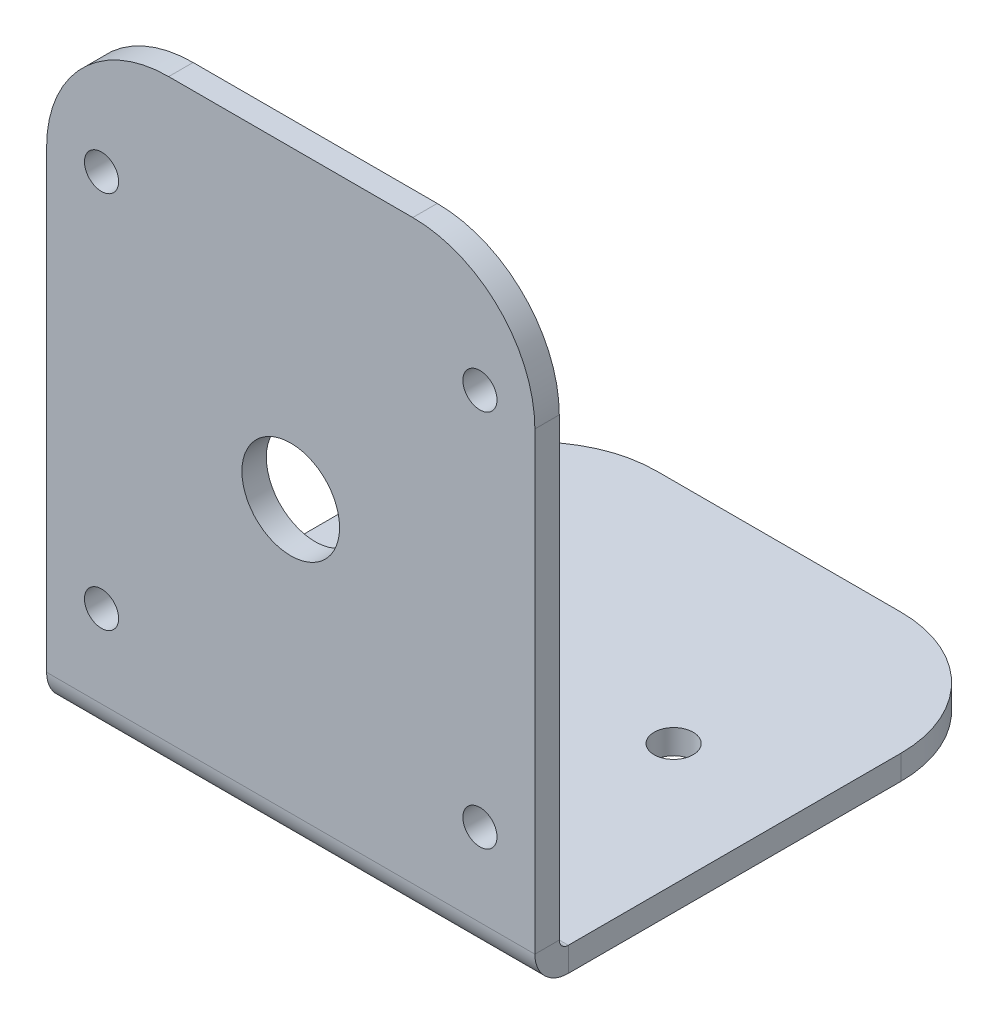
ISO-10303-21;
HEADER;
FILE_DESCRIPTION(('STEP AP214'),'2;1');
FILE_NAME('part.step','',(''),(''),'','','');
FILE_SCHEMA(('AUTOMOTIVE_DESIGN { 1 0 10303 214 1 1 1 1 }'));
ENDSEC;
DATA;
#1=APPLICATION_CONTEXT('core data for automotive mechanical design processes');
#2=APPLICATION_PROTOCOL_DEFINITION('international standard','automotive_design',2000,#1);
#3=PRODUCT_CONTEXT('',#1,'mechanical');
#4=PRODUCT('Part','Part','',(#3));
#5=PRODUCT_RELATED_PRODUCT_CATEGORY('part','',(#4));
#6=PRODUCT_DEFINITION_FORMATION('','',#4);
#7=PRODUCT_DEFINITION_CONTEXT('part definition',#1,'design');
#8=PRODUCT_DEFINITION('design','',#6,#7);
#9=PRODUCT_DEFINITION_SHAPE('','',#8);
#10=(LENGTH_UNIT() NAMED_UNIT(*) SI_UNIT(.MILLI.,.METRE.));
#11=(NAMED_UNIT(*) PLANE_ANGLE_UNIT() SI_UNIT($,.RADIAN.));
#12=(NAMED_UNIT(*) SI_UNIT($,.STERADIAN.) SOLID_ANGLE_UNIT());
#13=UNCERTAINTY_MEASURE_WITH_UNIT(LENGTH_MEASURE(1.E-05),#10,'distance_accuracy_value','');
#14=(GEOMETRIC_REPRESENTATION_CONTEXT(3) GLOBAL_UNCERTAINTY_ASSIGNED_CONTEXT((#13)) GLOBAL_UNIT_ASSIGNED_CONTEXT((#10,
#11,#12)) REPRESENTATION_CONTEXT('',''));
#15=CARTESIAN_POINT('',(0.,0.,0.));
#16=DIRECTION('',(0.,0.,1.));
#17=DIRECTION('',(1.,0.,0.));
#18=AXIS2_PLACEMENT_3D('',#15,#16,#17);
#19=CARTESIAN_POINT('',(-20.,25.,-2.));
#20=DIRECTION('',(-1.,0.,0.));
#21=DIRECTION('',(0.,-1.,0.));
#22=AXIS2_PLACEMENT_3D('',#19,#20,#21);
#23=PLANE('',#22);
#24=DIRECTION('',(0.,-1.,0.));
#25=VECTOR('',#24,1.);
#26=CARTESIAN_POINT('',(-20.,25.,0.));
#27=LINE('',#26,#25);
#28=CARTESIAN_POINT('',(-20.,15.,0.));
#29=VERTEX_POINT('',#28);
#30=CARTESIAN_POINT('',(-20.,-22.2634,0.));
#31=VERTEX_POINT('',#30);
#32=EDGE_CURVE('E219',#29,#31,#27,.T.);
#33=ORIENTED_EDGE('',*,*,#32,.F.);
#34=DIRECTION('',(0.,0.,1.));
#35=VECTOR('',#34,1.);
#36=CARTESIAN_POINT('',(-20.,15.,-2.));
#37=LINE('',#36,#35);
#38=CARTESIAN_POINT('',(-20.,15.,-2.));
#39=VERTEX_POINT('',#38);
#40=EDGE_CURVE('E78',#29,#39,#37,.F.);
#41=ORIENTED_EDGE('',*,*,#40,.T.);
#42=DIRECTION('',(0.,-1.,0.));
#43=VECTOR('',#42,1.);
#44=CARTESIAN_POINT('',(-20.,25.,-2.));
#45=LINE('',#44,#43);
#46=CARTESIAN_POINT('',(-20.,-22.2634,-2.));
#47=VERTEX_POINT('',#46);
#48=EDGE_CURVE('E222',#39,#47,#45,.T.);
#49=ORIENTED_EDGE('',*,*,#48,.T.);
#50=DIRECTION('',(0.,0.,1.));
#51=VECTOR('',#50,1.);
#52=CARTESIAN_POINT('',(-20.,-22.2634,-2.));
#53=LINE('',#52,#51);
#54=EDGE_CURVE('E204',#47,#31,#53,.T.);
#55=ORIENTED_EDGE('',*,*,#54,.T.);
#56=EDGE_LOOP('',(#33,#41,#49,#55));
#57=FACE_BOUND('',#56,.T.);
#58=ADVANCED_FACE('F55',(#57),#23,.T.);
#59=CARTESIAN_POINT('',(0.,0.,-2.));
#60=DIRECTION('',(0.,0.,1.));
#61=DIRECTION('',(1.,0.,0.));
#62=AXIS2_PLACEMENT_3D('',#59,#60,#61);
#63=PLANE('',#62);
#64=CARTESIAN_POINT('',(0.,0.,-2.));
#65=DIRECTION('',(0.,0.,-1.));
#66=DIRECTION('',(-1.,0.,0.));
#67=AXIS2_PLACEMENT_3D('',#64,#65,#66);
#68=CIRCLE('',#67,4.);
#69=CARTESIAN_POINT('',(-4.00000000000001,0.,-2.));
#70=VERTEX_POINT('',#69);
#71=EDGE_CURVE('E325',#70,#70,#68,.T.);
#72=ORIENTED_EDGE('',*,*,#71,.F.);
#73=EDGE_LOOP('',(#72));
#74=FACE_BOUND('',#73,.T.);
#75=CARTESIAN_POINT('',(15.5,-15.5,-2.));
#76=DIRECTION('',(0.,0.,-1.));
#77=DIRECTION('',(-1.,0.,0.));
#78=AXIS2_PLACEMENT_3D('',#75,#76,#77);
#79=CIRCLE('',#78,1.4);
#80=CARTESIAN_POINT('',(14.1,-15.5,-2.));
#81=VERTEX_POINT('',#80);
#82=EDGE_CURVE('E332',#81,#81,#79,.T.);
#83=ORIENTED_EDGE('',*,*,#82,.F.);
#84=EDGE_LOOP('',(#83));
#85=FACE_BOUND('',#84,.T.);
#86=CARTESIAN_POINT('',(-15.5,-15.5,-2.));
#87=DIRECTION('',(0.,0.,-1.));
#88=DIRECTION('',(-1.,0.,0.));
#89=AXIS2_PLACEMENT_3D('',#86,#87,#88);
#90=CIRCLE('',#89,1.4);
#91=CARTESIAN_POINT('',(-16.9,-15.5,-2.));
#92=VERTEX_POINT('',#91);
#93=EDGE_CURVE('E338',#92,#92,#90,.T.);
#94=ORIENTED_EDGE('',*,*,#93,.F.);
#95=EDGE_LOOP('',(#94));
#96=FACE_BOUND('',#95,.T.);
#97=CARTESIAN_POINT('',(-15.5,15.5,-2.));
#98=DIRECTION('',(0.,0.,-1.));
#99=DIRECTION('',(-1.,0.,0.));
#100=AXIS2_PLACEMENT_3D('',#97,#98,#99);
#101=CIRCLE('',#100,1.4);
#102=CARTESIAN_POINT('',(-16.9,15.5,-2.));
#103=VERTEX_POINT('',#102);
#104=EDGE_CURVE('E319',#103,#103,#101,.T.);
#105=ORIENTED_EDGE('',*,*,#104,.F.);
#106=EDGE_LOOP('',(#105));
#107=FACE_BOUND('',#106,.T.);
#108=CARTESIAN_POINT('',(15.5,15.5,-2.));
#109=DIRECTION('',(0.,0.,-1.));
#110=DIRECTION('',(-1.,0.,0.));
#111=AXIS2_PLACEMENT_3D('',#108,#109,#110);
#112=CIRCLE('',#111,1.4);
#113=CARTESIAN_POINT('',(14.1,15.5,-2.));
#114=VERTEX_POINT('',#113);
#115=EDGE_CURVE('E201',#114,#114,#112,.T.);
#116=ORIENTED_EDGE('',*,*,#115,.F.);
#117=EDGE_LOOP('',(#116));
#118=FACE_BOUND('',#117,.T.);
#119=ORIENTED_EDGE('',*,*,#48,.F.);
#120=CARTESIAN_POINT('',(-10.,15.,-2.));
#121=DIRECTION('',(0.,0.,1.));
#122=DIRECTION('',(1.,0.,0.));
#123=AXIS2_PLACEMENT_3D('',#120,#121,#122);
#124=CIRCLE('',#123,10.);
#125=CARTESIAN_POINT('',(-10.,25.,-2.));
#126=VERTEX_POINT('',#125);
#127=EDGE_CURVE('E63',#39,#126,#124,.F.);
#128=ORIENTED_EDGE('',*,*,#127,.T.);
#129=DIRECTION('',(-1.,0.,0.));
#130=VECTOR('',#129,1.);
#131=CARTESIAN_POINT('',(-20.,25.,-2.));
#132=LINE('',#131,#130);
#133=CARTESIAN_POINT('',(10.,25.,-2.));
#134=VERTEX_POINT('',#133);
#135=EDGE_CURVE('E218',#134,#126,#132,.T.);
#136=ORIENTED_EDGE('',*,*,#135,.F.);
#137=CARTESIAN_POINT('',(10.,15.,-2.));
#138=DIRECTION('',(0.,0.,1.));
#139=DIRECTION('',(1.,0.,0.));
#140=AXIS2_PLACEMENT_3D('',#137,#138,#139);
#141=CIRCLE('',#140,10.);
#142=CARTESIAN_POINT('',(20.,15.,-2.));
#143=VERTEX_POINT('',#142);
#144=EDGE_CURVE('E70',#134,#143,#141,.F.);
#145=ORIENTED_EDGE('',*,*,#144,.T.);
#146=DIRECTION('',(0.,1.,0.));
#147=VECTOR('',#146,1.);
#148=CARTESIAN_POINT('',(20.,25.,-2.));
#149=LINE('',#148,#147);
#150=CARTESIAN_POINT('',(20.,-22.2634,-2.));
#151=VERTEX_POINT('',#150);
#152=EDGE_CURVE('E216',#151,#143,#149,.T.);
#153=ORIENTED_EDGE('',*,*,#152,.F.);
#154=DIRECTION('',(-1.,0.,0.));
#155=VECTOR('',#154,1.);
#156=CARTESIAN_POINT('',(-20.,-22.2634,-2.));
#157=LINE('',#156,#155);
#158=EDGE_CURVE('E208',#47,#151,#157,.F.);
#159=ORIENTED_EDGE('',*,*,#158,.F.);
#160=EDGE_LOOP('',(#119,#128,#136,#145,#153,#159));
#161=FACE_BOUND('',#160,.T.);
#162=ADVANCED_FACE('F258',(#74,#85,#96,#107,#118,#161),#63,.F.);
#163=CARTESIAN_POINT('',(0.,0.,0.));
#164=DIRECTION('',(0.,0.,1.));
#165=DIRECTION('',(1.,0.,0.));
#166=AXIS2_PLACEMENT_3D('',#163,#164,#165);
#167=PLANE('',#166);
#168=CARTESIAN_POINT('',(0.,0.,0.));
#169=DIRECTION('',(0.,0.,1.));
#170=DIRECTION('',(1.,0.,0.));
#171=AXIS2_PLACEMENT_3D('',#168,#169,#170);
#172=CIRCLE('',#171,4.);
#173=CARTESIAN_POINT('',(3.99999999999999,0.,0.));
#174=VERTEX_POINT('',#173);
#175=EDGE_CURVE('E322',#174,#174,#172,.F.);
#176=ORIENTED_EDGE('',*,*,#175,.T.);
#177=EDGE_LOOP('',(#176));
#178=FACE_BOUND('',#177,.T.);
#179=CARTESIAN_POINT('',(15.5,-15.5,0.));
#180=DIRECTION('',(0.,0.,1.));
#181=DIRECTION('',(1.,0.,0.));
#182=AXIS2_PLACEMENT_3D('',#179,#180,#181);
#183=CIRCLE('',#182,1.4);
#184=CARTESIAN_POINT('',(16.9,-15.5,0.));
#185=VERTEX_POINT('',#184);
#186=EDGE_CURVE('E329',#185,#185,#183,.F.);
#187=ORIENTED_EDGE('',*,*,#186,.T.);
#188=EDGE_LOOP('',(#187));
#189=FACE_BOUND('',#188,.T.);
#190=CARTESIAN_POINT('',(-15.5,-15.5,0.));
#191=DIRECTION('',(0.,0.,1.));
#192=DIRECTION('',(1.,0.,0.));
#193=AXIS2_PLACEMENT_3D('',#190,#191,#192);
#194=CIRCLE('',#193,1.4);
#195=CARTESIAN_POINT('',(-14.1,-15.5,0.));
#196=VERTEX_POINT('',#195);
#197=EDGE_CURVE('E335',#196,#196,#194,.F.);
#198=ORIENTED_EDGE('',*,*,#197,.T.);
#199=EDGE_LOOP('',(#198));
#200=FACE_BOUND('',#199,.T.);
#201=CARTESIAN_POINT('',(-15.5,15.5,0.));
#202=DIRECTION('',(0.,0.,1.));
#203=DIRECTION('',(1.,0.,0.));
#204=AXIS2_PLACEMENT_3D('',#201,#202,#203);
#205=CIRCLE('',#204,1.4);
#206=CARTESIAN_POINT('',(-14.1,15.5,0.));
#207=VERTEX_POINT('',#206);
#208=EDGE_CURVE('E341',#207,#207,#205,.F.);
#209=ORIENTED_EDGE('',*,*,#208,.T.);
#210=EDGE_LOOP('',(#209));
#211=FACE_BOUND('',#210,.T.);
#212=CARTESIAN_POINT('',(15.5,15.5,0.));
#213=DIRECTION('',(0.,0.,1.));
#214=DIRECTION('',(1.,0.,0.));
#215=AXIS2_PLACEMENT_3D('',#212,#213,#214);
#216=CIRCLE('',#215,1.4);
#217=CARTESIAN_POINT('',(16.9,15.5,0.));
#218=VERTEX_POINT('',#217);
#219=EDGE_CURVE('E316',#218,#218,#216,.F.);
#220=ORIENTED_EDGE('',*,*,#219,.T.);
#221=EDGE_LOOP('',(#220));
#222=FACE_BOUND('',#221,.T.);
#223=DIRECTION('',(-1.,0.,0.));
#224=VECTOR('',#223,1.);
#225=CARTESIAN_POINT('',(-20.,25.,0.));
#226=LINE('',#225,#224);
#227=CARTESIAN_POINT('',(10.,25.,0.));
#228=VERTEX_POINT('',#227);
#229=CARTESIAN_POINT('',(-10.,25.,0.));
#230=VERTEX_POINT('',#229);
#231=EDGE_CURVE('E227',#228,#230,#226,.T.);
#232=ORIENTED_EDGE('',*,*,#231,.T.);
#233=CARTESIAN_POINT('',(-10.,15.,0.));
#234=DIRECTION('',(0.,0.,1.));
#235=DIRECTION('',(1.,0.,0.));
#236=AXIS2_PLACEMENT_3D('',#233,#234,#235);
#237=CIRCLE('',#236,10.);
#238=EDGE_CURVE('E254',#230,#29,#237,.T.);
#239=ORIENTED_EDGE('',*,*,#238,.T.);
#240=ORIENTED_EDGE('',*,*,#32,.T.);
#241=DIRECTION('',(-1.,0.,0.));
#242=VECTOR('',#241,1.);
#243=CARTESIAN_POINT('',(-20.,-22.2634,0.));
#244=LINE('',#243,#242);
#245=CARTESIAN_POINT('',(20.,-22.2634,0.));
#246=VERTEX_POINT('',#245);
#247=EDGE_CURVE('E155',#31,#246,#244,.F.);
#248=ORIENTED_EDGE('',*,*,#247,.T.);
#249=DIRECTION('',(0.,1.,0.));
#250=VECTOR('',#249,1.);
#251=CARTESIAN_POINT('',(20.,25.,0.));
#252=LINE('',#251,#250);
#253=CARTESIAN_POINT('',(20.,15.,0.));
#254=VERTEX_POINT('',#253);
#255=EDGE_CURVE('E214',#246,#254,#252,.T.);
#256=ORIENTED_EDGE('',*,*,#255,.T.);
#257=CARTESIAN_POINT('',(10.,15.,0.));
#258=DIRECTION('',(0.,0.,1.));
#259=DIRECTION('',(1.,0.,0.));
#260=AXIS2_PLACEMENT_3D('',#257,#258,#259);
#261=CIRCLE('',#260,10.);
#262=EDGE_CURVE('E252',#254,#228,#261,.T.);
#263=ORIENTED_EDGE('',*,*,#262,.T.);
#264=EDGE_LOOP('',(#232,#239,#240,#248,#256,#263));
#265=FACE_BOUND('',#264,.T.);
#266=ADVANCED_FACE('F268',(#178,#189,#200,#211,#222,#265),#167,.T.);
#267=CARTESIAN_POINT('',(20.,25.,-2.));
#268=DIRECTION('',(1.,0.,0.));
#269=DIRECTION('',(0.,1.,0.));
#270=AXIS2_PLACEMENT_3D('',#267,#268,#269);
#271=PLANE('',#270);
#272=ORIENTED_EDGE('',*,*,#152,.T.);
#273=DIRECTION('',(0.,0.,1.));
#274=VECTOR('',#273,1.);
#275=CARTESIAN_POINT('',(20.,15.,-2.));
#276=LINE('',#275,#274);
#277=EDGE_CURVE('E13',#143,#254,#276,.T.);
#278=ORIENTED_EDGE('',*,*,#277,.T.);
#279=ORIENTED_EDGE('',*,*,#255,.F.);
#280=DIRECTION('',(0.,0.,1.));
#281=VECTOR('',#280,1.);
#282=CARTESIAN_POINT('',(20.,-22.2634,-2.));
#283=LINE('',#282,#281);
#284=EDGE_CURVE('E211',#151,#246,#283,.T.);
#285=ORIENTED_EDGE('',*,*,#284,.F.);
#286=EDGE_LOOP('',(#272,#278,#279,#285));
#287=FACE_BOUND('',#286,.T.);
#288=ADVANCED_FACE('F276',(#287),#271,.T.);
#289=CARTESIAN_POINT('',(-20.,25.,-2.));
#290=DIRECTION('',(0.,1.,0.));
#291=DIRECTION('',(0.,0.,1.));
#292=AXIS2_PLACEMENT_3D('',#289,#290,#291);
#293=PLANE('',#292);
#294=ORIENTED_EDGE('',*,*,#135,.T.);
#295=DIRECTION('',(0.,0.,1.));
#296=VECTOR('',#295,1.);
#297=CARTESIAN_POINT('',(-10.,25.,-2.));
#298=LINE('',#297,#296);
#299=EDGE_CURVE('E249',#126,#230,#298,.T.);
#300=ORIENTED_EDGE('',*,*,#299,.T.);
#301=ORIENTED_EDGE('',*,*,#231,.F.);
#302=DIRECTION('',(0.,0.,1.));
#303=VECTOR('',#302,1.);
#304=CARTESIAN_POINT('',(10.,25.,-2.));
#305=LINE('',#304,#303);
#306=EDGE_CURVE('E247',#228,#134,#305,.F.);
#307=ORIENTED_EDGE('',*,*,#306,.T.);
#308=EDGE_LOOP('',(#294,#300,#301,#307));
#309=FACE_BOUND('',#308,.T.);
#310=ADVANCED_FACE('F263',(#309),#293,.T.);
#311=CARTESIAN_POINT('',(20.,-22.2634,-2.7366));
#312=DIRECTION('',(1.,0.,0.));
#313=DIRECTION('',(0.,0.,-1.));
#314=AXIS2_PLACEMENT_3D('',#311,#312,#313);
#315=PLANE('',#314);
#316=DIRECTION('',(0.,1.,0.));
#317=VECTOR('',#316,1.);
#318=CARTESIAN_POINT('',(20.,-25.,-2.73659999999999));
#319=LINE('',#318,#317);
#320=CARTESIAN_POINT('',(20.,-23.,-2.7366));
#321=VERTEX_POINT('',#320);
#322=CARTESIAN_POINT('',(20.,-25.,-2.73659999999999));
#323=VERTEX_POINT('',#322);
#324=EDGE_CURVE('E198',#321,#323,#319,.F.);
#325=ORIENTED_EDGE('',*,*,#324,.F.);
#326=CARTESIAN_POINT('',(20.,-22.2634,-2.7366));
#327=DIRECTION('',(-1.,0.,0.));
#328=DIRECTION('',(0.,0.,1.));
#329=AXIS2_PLACEMENT_3D('',#326,#327,#328);
#330=CIRCLE('',#329,0.7366);
#331=EDGE_CURVE('E159',#151,#321,#330,.F.);
#332=ORIENTED_EDGE('',*,*,#331,.F.);
#333=ORIENTED_EDGE('',*,*,#284,.T.);
#334=CARTESIAN_POINT('',(20.,-22.2634,-2.7366));
#335=DIRECTION('',(-1.,0.,0.));
#336=DIRECTION('',(0.,0.,1.));
#337=AXIS2_PLACEMENT_3D('',#334,#335,#336);
#338=CIRCLE('',#337,2.7366);
#339=EDGE_CURVE('E203',#246,#323,#338,.F.);
#340=ORIENTED_EDGE('',*,*,#339,.T.);
#341=EDGE_LOOP('',(#325,#332,#333,#340));
#342=FACE_BOUND('',#341,.T.);
#343=ADVANCED_FACE('F295',(#342),#315,.T.);
#344=CARTESIAN_POINT('',(-20.,-22.2634,-2.7366));
#345=DIRECTION('',(1.,0.,0.));
#346=DIRECTION('',(0.,0.,-1.));
#347=AXIS2_PLACEMENT_3D('',#344,#345,#346);
#348=PLANE('',#347);
#349=CARTESIAN_POINT('',(-20.,-22.2634,-2.7366));
#350=DIRECTION('',(-1.,0.,0.));
#351=DIRECTION('',(0.,0.,1.));
#352=AXIS2_PLACEMENT_3D('',#349,#350,#351);
#353=CIRCLE('',#352,0.7366);
#354=CARTESIAN_POINT('',(-20.,-23.,-2.7366));
#355=VERTEX_POINT('',#354);
#356=EDGE_CURVE('E166',#355,#47,#353,.T.);
#357=ORIENTED_EDGE('',*,*,#356,.F.);
#358=DIRECTION('',(0.,1.,0.));
#359=VECTOR('',#358,1.);
#360=CARTESIAN_POINT('',(-20.,-23.,-2.7366));
#361=LINE('',#360,#359);
#362=CARTESIAN_POINT('',(-20.,-25.,-2.73659999999999));
#363=VERTEX_POINT('',#362);
#364=EDGE_CURVE('E163',#355,#363,#361,.F.);
#365=ORIENTED_EDGE('',*,*,#364,.T.);
#366=CARTESIAN_POINT('',(-20.,-22.2634,-2.7366));
#367=DIRECTION('',(-1.,0.,0.));
#368=DIRECTION('',(0.,0.,1.));
#369=AXIS2_PLACEMENT_3D('',#366,#367,#368);
#370=CIRCLE('',#369,2.7366);
#371=EDGE_CURVE('E148',#363,#31,#370,.T.);
#372=ORIENTED_EDGE('',*,*,#371,.T.);
#373=ORIENTED_EDGE('',*,*,#54,.F.);
#374=EDGE_LOOP('',(#357,#365,#372,#373));
#375=FACE_BOUND('',#374,.T.);
#376=ADVANCED_FACE('F164',(#375),#348,.F.);
#377=CARTESIAN_POINT('',(-20.,-22.2634,-2.7366));
#378=DIRECTION('',(-1.,0.,0.));
#379=DIRECTION('',(0.,-1.,0.));
#380=AXIS2_PLACEMENT_3D('',#377,#378,#379);
#381=CYLINDRICAL_SURFACE('',#380,2.7366);
#382=ORIENTED_EDGE('',*,*,#247,.F.);
#383=ORIENTED_EDGE('',*,*,#371,.F.);
#384=DIRECTION('',(-1.,0.,0.));
#385=VECTOR('',#384,1.);
#386=CARTESIAN_POINT('',(20.,-25.,-2.73659999999999));
#387=LINE('',#386,#385);
#388=EDGE_CURVE('E152',#363,#323,#387,.F.);
#389=ORIENTED_EDGE('',*,*,#388,.T.);
#390=ORIENTED_EDGE('',*,*,#339,.F.);
#391=EDGE_LOOP('',(#382,#383,#389,#390));
#392=FACE_BOUND('',#391,.T.);
#393=ADVANCED_FACE('F150',(#392),#381,.T.);
#394=CARTESIAN_POINT('',(-20.,-22.2634,-2.7366));
#395=DIRECTION('',(-1.,0.,0.));
#396=DIRECTION('',(0.,-1.,0.));
#397=AXIS2_PLACEMENT_3D('',#394,#395,#396);
#398=CYLINDRICAL_SURFACE('',#397,0.7366);
#399=ORIENTED_EDGE('',*,*,#158,.T.);
#400=ORIENTED_EDGE('',*,*,#331,.T.);
#401=DIRECTION('',(-1.,0.,0.));
#402=VECTOR('',#401,1.);
#403=CARTESIAN_POINT('',(20.,-23.,-2.7366));
#404=LINE('',#403,#402);
#405=EDGE_CURVE('E171',#321,#355,#404,.T.);
#406=ORIENTED_EDGE('',*,*,#405,.T.);
#407=ORIENTED_EDGE('',*,*,#356,.T.);
#408=EDGE_LOOP('',(#399,#400,#406,#407));
#409=FACE_BOUND('',#408,.T.);
#410=ADVANCED_FACE('F270',(#409),#398,.F.);
#411=CARTESIAN_POINT('',(-20.,-25.0000000000001,-40.));
#412=DIRECTION('',(1.,0.,0.));
#413=DIRECTION('',(0.,0.,-1.));
#414=AXIS2_PLACEMENT_3D('',#411,#412,#413);
#415=PLANE('',#414);
#416=DIRECTION('',(0.,0.,1.));
#417=VECTOR('',#416,1.);
#418=CARTESIAN_POINT('',(-20.,-23.0000000000001,-40.));
#419=LINE('',#418,#417);
#420=CARTESIAN_POINT('',(-20.,-23.0000000000001,-30.));
#421=VERTEX_POINT('',#420);
#422=EDGE_CURVE('E180',#355,#421,#419,.F.);
#423=ORIENTED_EDGE('',*,*,#422,.T.);
#424=DIRECTION('',(0.,1.,0.));
#425=VECTOR('',#424,1.);
#426=CARTESIAN_POINT('',(-20.,-25.0000000000001,-30.));
#427=LINE('',#426,#425);
#428=CARTESIAN_POINT('',(-20.,-25.0000000000001,-30.));
#429=VERTEX_POINT('',#428);
#430=EDGE_CURVE('E184',#421,#429,#427,.F.);
#431=ORIENTED_EDGE('',*,*,#430,.T.);
#432=DIRECTION('',(0.,0.,-1.));
#433=VECTOR('',#432,1.);
#434=CARTESIAN_POINT('',(-20.,-25.,0.));
#435=LINE('',#434,#433);
#436=EDGE_CURVE('E176',#363,#429,#435,.T.);
#437=ORIENTED_EDGE('',*,*,#436,.F.);
#438=ORIENTED_EDGE('',*,*,#364,.F.);
#439=EDGE_LOOP('',(#423,#431,#437,#438));
#440=FACE_BOUND('',#439,.T.);
#441=ADVANCED_FACE('F182',(#440),#415,.F.);
#442=CARTESIAN_POINT('',(20.,-25.,-1.99999999999999));
#443=DIRECTION('',(-1.,0.,0.));
#444=DIRECTION('',(0.,0.,1.));
#445=AXIS2_PLACEMENT_3D('',#442,#443,#444);
#446=PLANE('',#445);
#447=DIRECTION('',(0.,0.,1.));
#448=VECTOR('',#447,1.);
#449=CARTESIAN_POINT('',(20.,-25.,0.));
#450=LINE('',#449,#448);
#451=CARTESIAN_POINT('',(20.,-25.0000000000001,-30.));
#452=VERTEX_POINT('',#451);
#453=EDGE_CURVE('E179',#452,#323,#450,.T.);
#454=ORIENTED_EDGE('',*,*,#453,.F.);
#455=DIRECTION('',(0.,1.,0.));
#456=VECTOR('',#455,1.);
#457=CARTESIAN_POINT('',(20.,-25.0000000000001,-30.));
#458=LINE('',#457,#456);
#459=CARTESIAN_POINT('',(20.,-23.0000000000001,-30.));
#460=VERTEX_POINT('',#459);
#461=EDGE_CURVE('E244',#452,#460,#458,.T.);
#462=ORIENTED_EDGE('',*,*,#461,.T.);
#463=DIRECTION('',(0.,0.,-1.));
#464=VECTOR('',#463,1.);
#465=CARTESIAN_POINT('',(20.,-23.,-2.));
#466=LINE('',#465,#464);
#467=EDGE_CURVE('E186',#460,#321,#466,.F.);
#468=ORIENTED_EDGE('',*,*,#467,.T.);
#469=ORIENTED_EDGE('',*,*,#324,.T.);
#470=EDGE_LOOP('',(#454,#462,#468,#469));
#471=FACE_BOUND('',#470,.T.);
#472=ADVANCED_FACE('F312',(#471),#446,.F.);
#473=CARTESIAN_POINT('',(0.,-25.,0.));
#474=DIRECTION('',(0.,1.,0.));
#475=DIRECTION('',(0.,0.,1.));
#476=AXIS2_PLACEMENT_3D('',#473,#474,#475);
#477=PLANE('',#476);
#478=CARTESIAN_POINT('',(-10.,-25.,-21.3683));
#479=DIRECTION('',(0.,-1.,0.));
#480=DIRECTION('',(0.,0.,-1.));
#481=AXIS2_PLACEMENT_3D('',#478,#479,#480);
#482=CIRCLE('',#481,1.6);
#483=CARTESIAN_POINT('',(-10.,-25.0000000000001,-22.9683));
#484=VERTEX_POINT('',#483);
#485=EDGE_CURVE('E326',#484,#484,#482,.T.);
#486=ORIENTED_EDGE('',*,*,#485,.F.);
#487=EDGE_LOOP('',(#486));
#488=FACE_BOUND('',#487,.T.);
#489=CARTESIAN_POINT('',(10.,-25.,-21.3683));
#490=DIRECTION('',(0.,-1.,0.));
#491=DIRECTION('',(0.,0.,-1.));
#492=AXIS2_PLACEMENT_3D('',#489,#490,#491);
#493=CIRCLE('',#492,1.6);
#494=CARTESIAN_POINT('',(10.,-25.0000000000001,-22.9683));
#495=VERTEX_POINT('',#494);
#496=EDGE_CURVE('E349',#495,#495,#493,.T.);
#497=ORIENTED_EDGE('',*,*,#496,.F.);
#498=EDGE_LOOP('',(#497));
#499=FACE_BOUND('',#498,.T.);
#500=ORIENTED_EDGE('',*,*,#436,.T.);
#501=CARTESIAN_POINT('',(-9.99999999999999,-25.0000000000001,-30.));
#502=DIRECTION('',(0.,1.,0.));
#503=DIRECTION('',(0.,0.,1.));
#504=AXIS2_PLACEMENT_3D('',#501,#502,#503);
#505=CIRCLE('',#504,10.);
#506=CARTESIAN_POINT('',(-9.99999999999999,-25.0000000000001,-40.));
#507=VERTEX_POINT('',#506);
#508=EDGE_CURVE('E242',#429,#507,#505,.F.);
#509=ORIENTED_EDGE('',*,*,#508,.T.);
#510=DIRECTION('',(1.,0.,0.));
#511=VECTOR('',#510,1.);
#512=CARTESIAN_POINT('',(0.,-25.0000000000001,-40.));
#513=LINE('',#512,#511);
#514=CARTESIAN_POINT('',(10.,-25.0000000000001,-40.));
#515=VERTEX_POINT('',#514);
#516=EDGE_CURVE('E185',#507,#515,#513,.T.);
#517=ORIENTED_EDGE('',*,*,#516,.T.);
#518=CARTESIAN_POINT('',(10.,-25.0000000000001,-30.));
#519=DIRECTION('',(0.,1.,0.));
#520=DIRECTION('',(0.,0.,1.));
#521=AXIS2_PLACEMENT_3D('',#518,#519,#520);
#522=CIRCLE('',#521,10.);
#523=EDGE_CURVE('E240',#515,#452,#522,.F.);
#524=ORIENTED_EDGE('',*,*,#523,.T.);
#525=ORIENTED_EDGE('',*,*,#453,.T.);
#526=ORIENTED_EDGE('',*,*,#388,.F.);
#527=EDGE_LOOP('',(#500,#509,#517,#524,#525,#526));
#528=FACE_BOUND('',#527,.T.);
#529=ADVANCED_FACE('F175',(#488,#499,#528),#477,.F.);
#530=CARTESIAN_POINT('',(0.,-23.,0.));
#531=DIRECTION('',(0.,1.,0.));
#532=DIRECTION('',(0.,0.,1.));
#533=AXIS2_PLACEMENT_3D('',#530,#531,#532);
#534=PLANE('',#533);
#535=CARTESIAN_POINT('',(-10.,-23.0000000000001,-21.3683));
#536=DIRECTION('',(0.,1.,0.));
#537=DIRECTION('',(0.,0.,1.));
#538=AXIS2_PLACEMENT_3D('',#535,#536,#537);
#539=CIRCLE('',#538,1.6);
#540=CARTESIAN_POINT('',(-10.,-23.0000000000001,-19.7683));
#541=VERTEX_POINT('',#540);
#542=EDGE_CURVE('E352',#541,#541,#539,.F.);
#543=ORIENTED_EDGE('',*,*,#542,.T.);
#544=EDGE_LOOP('',(#543));
#545=FACE_BOUND('',#544,.T.);
#546=CARTESIAN_POINT('',(10.,-23.0000000000001,-21.3683));
#547=DIRECTION('',(0.,1.,0.));
#548=DIRECTION('',(0.,0.,1.));
#549=AXIS2_PLACEMENT_3D('',#546,#547,#548);
#550=CIRCLE('',#549,1.6);
#551=CARTESIAN_POINT('',(10.,-23.0000000000001,-19.7683));
#552=VERTEX_POINT('',#551);
#553=EDGE_CURVE('E346',#552,#552,#550,.F.);
#554=ORIENTED_EDGE('',*,*,#553,.T.);
#555=EDGE_LOOP('',(#554));
#556=FACE_BOUND('',#555,.T.);
#557=DIRECTION('',(-1.,0.,0.));
#558=VECTOR('',#557,1.);
#559=CARTESIAN_POINT('',(20.,-23.0000000000001,-40.));
#560=LINE('',#559,#558);
#561=CARTESIAN_POINT('',(-9.99999999999999,-23.0000000000001,-40.));
#562=VERTEX_POINT('',#561);
#563=CARTESIAN_POINT('',(10.,-23.0000000000001,-40.));
#564=VERTEX_POINT('',#563);
#565=EDGE_CURVE('E190',#562,#564,#560,.F.);
#566=ORIENTED_EDGE('',*,*,#565,.F.);
#567=CARTESIAN_POINT('',(-9.99999999999999,-23.0000000000001,-30.));
#568=DIRECTION('',(0.,1.,0.));
#569=DIRECTION('',(0.,0.,1.));
#570=AXIS2_PLACEMENT_3D('',#567,#568,#569);
#571=CIRCLE('',#570,10.);
#572=EDGE_CURVE('E237',#562,#421,#571,.T.);
#573=ORIENTED_EDGE('',*,*,#572,.T.);
#574=ORIENTED_EDGE('',*,*,#422,.F.);
#575=ORIENTED_EDGE('',*,*,#405,.F.);
#576=ORIENTED_EDGE('',*,*,#467,.F.);
#577=CARTESIAN_POINT('',(10.,-23.0000000000001,-30.));
#578=DIRECTION('',(0.,1.,0.));
#579=DIRECTION('',(0.,0.,1.));
#580=AXIS2_PLACEMENT_3D('',#577,#578,#579);
#581=CIRCLE('',#580,10.);
#582=EDGE_CURVE('E235',#460,#564,#581,.T.);
#583=ORIENTED_EDGE('',*,*,#582,.T.);
#584=EDGE_LOOP('',(#566,#573,#574,#575,#576,#583));
#585=FACE_BOUND('',#584,.T.);
#586=ADVANCED_FACE('F361',(#545,#556,#585),#534,.T.);
#587=CARTESIAN_POINT('',(20.,-25.0000000000001,-40.));
#588=DIRECTION('',(0.,0.,1.));
#589=DIRECTION('',(0.,-1.,0.));
#590=AXIS2_PLACEMENT_3D('',#587,#588,#589);
#591=PLANE('',#590);
#592=ORIENTED_EDGE('',*,*,#516,.F.);
#593=DIRECTION('',(0.,1.,0.));
#594=VECTOR('',#593,1.);
#595=CARTESIAN_POINT('',(-9.99999999999999,-25.0000000000001,-40.));
#596=LINE('',#595,#594);
#597=EDGE_CURVE('E232',#507,#562,#596,.T.);
#598=ORIENTED_EDGE('',*,*,#597,.T.);
#599=ORIENTED_EDGE('',*,*,#565,.T.);
#600=DIRECTION('',(0.,1.,0.));
#601=VECTOR('',#600,1.);
#602=CARTESIAN_POINT('',(10.,-25.0000000000001,-40.));
#603=LINE('',#602,#601);
#604=EDGE_CURVE('E224',#564,#515,#603,.F.);
#605=ORIENTED_EDGE('',*,*,#604,.T.);
#606=EDGE_LOOP('',(#592,#598,#599,#605));
#607=FACE_BOUND('',#606,.T.);
#608=ADVANCED_FACE('F394',(#607),#591,.F.);
#609=CARTESIAN_POINT('',(15.5,15.5,0.00100000000000273));
#610=DIRECTION('',(0.,0.,-1.));
#611=DIRECTION('',(-1.,0.,0.));
#612=AXIS2_PLACEMENT_3D('',#609,#610,#611);
#613=CYLINDRICAL_SURFACE('',#612,1.4);
#614=ORIENTED_EDGE('',*,*,#219,.F.);
#615=EDGE_LOOP('',(#614));
#616=FACE_BOUND('',#615,.T.);
#617=ORIENTED_EDGE('',*,*,#115,.T.);
#618=EDGE_LOOP('',(#617));
#619=FACE_BOUND('',#618,.T.);
#620=ADVANCED_FACE('F385',(#616,#619),#613,.F.);
#621=CARTESIAN_POINT('',(-15.5,15.5,0.00100000000000273));
#622=DIRECTION('',(0.,0.,-1.));
#623=DIRECTION('',(-1.,0.,0.));
#624=AXIS2_PLACEMENT_3D('',#621,#622,#623);
#625=CYLINDRICAL_SURFACE('',#624,1.4);
#626=ORIENTED_EDGE('',*,*,#208,.F.);
#627=EDGE_LOOP('',(#626));
#628=FACE_BOUND('',#627,.T.);
#629=ORIENTED_EDGE('',*,*,#104,.T.);
#630=EDGE_LOOP('',(#629));
#631=FACE_BOUND('',#630,.T.);
#632=ADVANCED_FACE('F381',(#628,#631),#625,.F.);
#633=CARTESIAN_POINT('',(-15.5,-15.5,0.00100000000000273));
#634=DIRECTION('',(0.,0.,-1.));
#635=DIRECTION('',(-1.,0.,0.));
#636=AXIS2_PLACEMENT_3D('',#633,#634,#635);
#637=CYLINDRICAL_SURFACE('',#636,1.4);
#638=ORIENTED_EDGE('',*,*,#197,.F.);
#639=EDGE_LOOP('',(#638));
#640=FACE_BOUND('',#639,.T.);
#641=ORIENTED_EDGE('',*,*,#93,.T.);
#642=EDGE_LOOP('',(#641));
#643=FACE_BOUND('',#642,.T.);
#644=ADVANCED_FACE('F384',(#640,#643),#637,.F.);
#645=CARTESIAN_POINT('',(15.5,-15.5,0.00100000000000273));
#646=DIRECTION('',(0.,0.,-1.));
#647=DIRECTION('',(-1.,0.,0.));
#648=AXIS2_PLACEMENT_3D('',#645,#646,#647);
#649=CYLINDRICAL_SURFACE('',#648,1.4);
#650=ORIENTED_EDGE('',*,*,#186,.F.);
#651=EDGE_LOOP('',(#650));
#652=FACE_BOUND('',#651,.T.);
#653=ORIENTED_EDGE('',*,*,#82,.T.);
#654=EDGE_LOOP('',(#653));
#655=FACE_BOUND('',#654,.T.);
#656=ADVANCED_FACE('F376',(#652,#655),#649,.F.);
#657=CARTESIAN_POINT('',(0.,0.,0.00100000000000273));
#658=DIRECTION('',(0.,0.,-1.));
#659=DIRECTION('',(-1.,0.,0.));
#660=AXIS2_PLACEMENT_3D('',#657,#658,#659);
#661=CYLINDRICAL_SURFACE('',#660,4.);
#662=ORIENTED_EDGE('',*,*,#175,.F.);
#663=EDGE_LOOP('',(#662));
#664=FACE_BOUND('',#663,.T.);
#665=ORIENTED_EDGE('',*,*,#71,.T.);
#666=EDGE_LOOP('',(#665));
#667=FACE_BOUND('',#666,.T.);
#668=ADVANCED_FACE('F367',(#664,#667),#661,.F.);
#669=CARTESIAN_POINT('',(10.,25.0010000000001,-21.3683000000002));
#670=DIRECTION('',(0.,-1.,0.));
#671=DIRECTION('',(0.,0.,-1.));
#672=AXIS2_PLACEMENT_3D('',#669,#670,#671);
#673=CYLINDRICAL_SURFACE('',#672,1.6);
#674=ORIENTED_EDGE('',*,*,#553,.F.);
#675=EDGE_LOOP('',(#674));
#676=FACE_BOUND('',#675,.T.);
#677=ORIENTED_EDGE('',*,*,#496,.T.);
#678=EDGE_LOOP('',(#677));
#679=FACE_BOUND('',#678,.T.);
#680=ADVANCED_FACE('F365',(#676,#679),#673,.F.);
#681=CARTESIAN_POINT('',(-10.,25.0010000000001,-21.3683000000002));
#682=DIRECTION('',(0.,-1.,0.));
#683=DIRECTION('',(0.,0.,-1.));
#684=AXIS2_PLACEMENT_3D('',#681,#682,#683);
#685=CYLINDRICAL_SURFACE('',#684,1.6);
#686=ORIENTED_EDGE('',*,*,#542,.F.);
#687=EDGE_LOOP('',(#686));
#688=FACE_BOUND('',#687,.T.);
#689=ORIENTED_EDGE('',*,*,#485,.T.);
#690=EDGE_LOOP('',(#689));
#691=FACE_BOUND('',#690,.T.);
#692=ADVANCED_FACE('F301',(#688,#691),#685,.F.);
#693=CARTESIAN_POINT('',(-9.99999999999999,-25.0000000000001,-30.));
#694=DIRECTION('',(0.,1.,0.));
#695=DIRECTION('',(0.,0.,1.));
#696=AXIS2_PLACEMENT_3D('',#693,#694,#695);
#697=CYLINDRICAL_SURFACE('',#696,10.);
#698=ORIENTED_EDGE('',*,*,#508,.F.);
#699=ORIENTED_EDGE('',*,*,#430,.F.);
#700=ORIENTED_EDGE('',*,*,#572,.F.);
#701=ORIENTED_EDGE('',*,*,#597,.F.);
#702=EDGE_LOOP('',(#698,#699,#700,#701));
#703=FACE_BOUND('',#702,.T.);
#704=ADVANCED_FACE('F298',(#703),#697,.T.);
#705=CARTESIAN_POINT('',(10.,-25.0000000000001,-30.));
#706=DIRECTION('',(0.,1.,0.));
#707=DIRECTION('',(0.,0.,1.));
#708=AXIS2_PLACEMENT_3D('',#705,#706,#707);
#709=CYLINDRICAL_SURFACE('',#708,10.);
#710=ORIENTED_EDGE('',*,*,#523,.F.);
#711=ORIENTED_EDGE('',*,*,#604,.F.);
#712=ORIENTED_EDGE('',*,*,#582,.F.);
#713=ORIENTED_EDGE('',*,*,#461,.F.);
#714=EDGE_LOOP('',(#710,#711,#712,#713));
#715=FACE_BOUND('',#714,.T.);
#716=ADVANCED_FACE('F283',(#715),#709,.T.);
#717=CARTESIAN_POINT('',(-10.,15.,-2.));
#718=DIRECTION('',(0.,0.,1.));
#719=DIRECTION('',(1.,0.,0.));
#720=AXIS2_PLACEMENT_3D('',#717,#718,#719);
#721=CYLINDRICAL_SURFACE('',#720,10.);
#722=ORIENTED_EDGE('',*,*,#127,.F.);
#723=ORIENTED_EDGE('',*,*,#40,.F.);
#724=ORIENTED_EDGE('',*,*,#238,.F.);
#725=ORIENTED_EDGE('',*,*,#299,.F.);
#726=EDGE_LOOP('',(#722,#723,#724,#725));
#727=FACE_BOUND('',#726,.T.);
#728=ADVANCED_FACE('F266',(#727),#721,.T.);
#729=CARTESIAN_POINT('',(10.,15.,-2.));
#730=DIRECTION('',(0.,0.,1.));
#731=DIRECTION('',(1.,0.,0.));
#732=AXIS2_PLACEMENT_3D('',#729,#730,#731);
#733=CYLINDRICAL_SURFACE('',#732,10.);
#734=ORIENTED_EDGE('',*,*,#144,.F.);
#735=ORIENTED_EDGE('',*,*,#306,.F.);
#736=ORIENTED_EDGE('',*,*,#262,.F.);
#737=ORIENTED_EDGE('',*,*,#277,.F.);
#738=EDGE_LOOP('',(#734,#735,#736,#737));
#739=FACE_BOUND('',#738,.T.);
#740=ADVANCED_FACE('F57',(#739),#733,.T.);
#741=CLOSED_SHELL('',(#58,#162,#266,#288,#310,#343,#376,#393,#410,#441,#472,#529,#586,#608,#620,
#632,#644,#656,#668,#680,#692,#704,#716,#728,#740));
#742=MANIFOLD_SOLID_BREP('B2',#741);
#743=ADVANCED_BREP_SHAPE_REPRESENTATION('',(#18,#742),#14);
#744=SHAPE_DEFINITION_REPRESENTATION(#9,#743);
ENDSEC;
END-ISO-10303-21;
